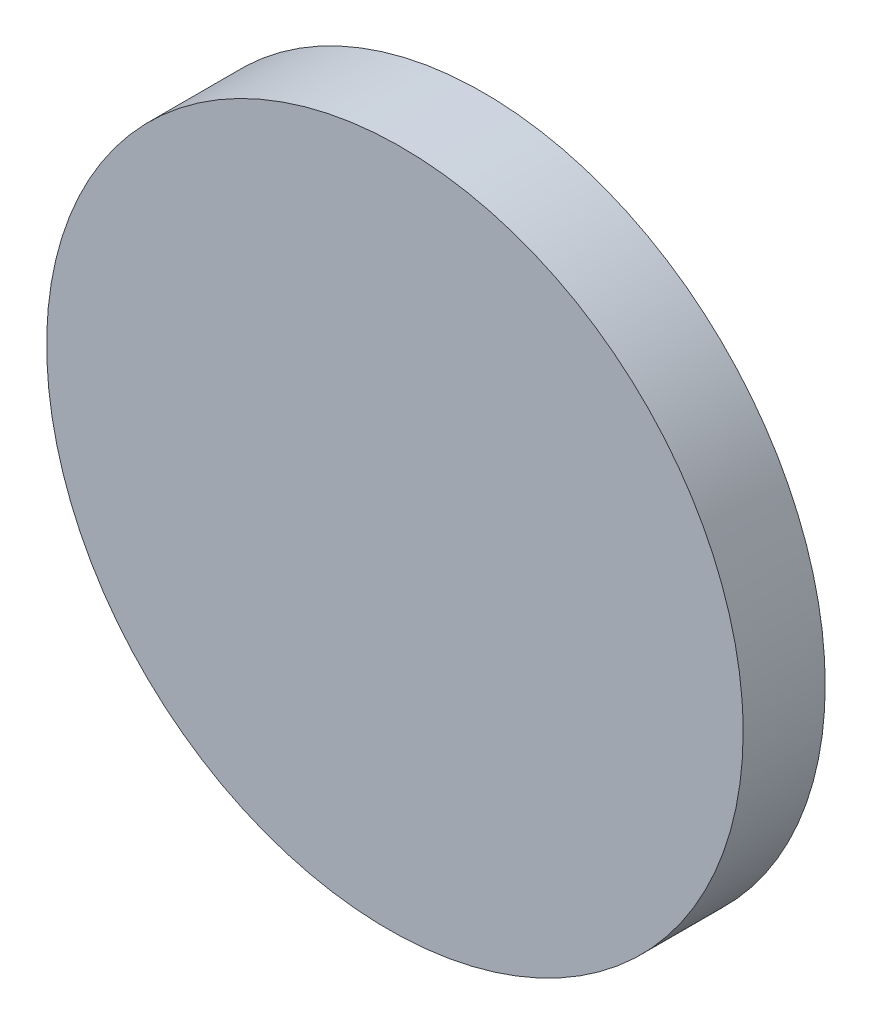
ISO-10303-21;
HEADER;
FILE_DESCRIPTION(('STEP AP214'),'2;1');
FILE_NAME('part.step','',(''),(''),'','','');
FILE_SCHEMA(('AUTOMOTIVE_DESIGN { 1 0 10303 214 1 1 1 1 }'));
ENDSEC;
DATA;
#1=APPLICATION_CONTEXT('core data for automotive mechanical design processes');
#2=APPLICATION_PROTOCOL_DEFINITION('international standard','automotive_design',2000,#1);
#3=PRODUCT_CONTEXT('',#1,'mechanical');
#4=PRODUCT('Part','Part','',(#3));
#5=PRODUCT_RELATED_PRODUCT_CATEGORY('part','',(#4));
#6=PRODUCT_DEFINITION_FORMATION('','',#4);
#7=PRODUCT_DEFINITION_CONTEXT('part definition',#1,'design');
#8=PRODUCT_DEFINITION('design','',#6,#7);
#9=PRODUCT_DEFINITION_SHAPE('','',#8);
#10=(LENGTH_UNIT() NAMED_UNIT(*) SI_UNIT(.MILLI.,.METRE.));
#11=(NAMED_UNIT(*) PLANE_ANGLE_UNIT() SI_UNIT($,.RADIAN.));
#12=(NAMED_UNIT(*) SI_UNIT($,.STERADIAN.) SOLID_ANGLE_UNIT());
#13=UNCERTAINTY_MEASURE_WITH_UNIT(LENGTH_MEASURE(1.E-05),#10,'distance_accuracy_value','');
#14=(GEOMETRIC_REPRESENTATION_CONTEXT(3) GLOBAL_UNCERTAINTY_ASSIGNED_CONTEXT((#13)) GLOBAL_UNIT_ASSIGNED_CONTEXT((#10,
#11,#12)) REPRESENTATION_CONTEXT('',''));
#15=CARTESIAN_POINT('',(0.,0.,0.));
#16=DIRECTION('',(0.,0.,1.));
#17=DIRECTION('',(1.,0.,0.));
#18=AXIS2_PLACEMENT_3D('',#15,#16,#17);
#19=CARTESIAN_POINT('',(0.,0.,10.));
#20=DIRECTION('',(0.,0.,-1.));
#21=DIRECTION('',(-1.,0.,0.));
#22=AXIS2_PLACEMENT_3D('',#19,#20,#21);
#23=CYLINDRICAL_SURFACE('',#22,12.5);
#24=CARTESIAN_POINT('',(0.,0.,3.22910011194622));
#25=DIRECTION('',(-0.0183249313961028,0.,-0.999832084346831));
#26=DIRECTION('',(0.999832084346831,0.,-0.0183249313961028));
#27=AXIS2_PLACEMENT_3D('',#24,#25,#26);
#28=ELLIPSE('',#27,12.5020992981696,12.5);
#29=CARTESIAN_POINT('',(12.5,0.,3.));
#30=VERTEX_POINT('',#29);
#31=EDGE_CURVE('E36',#30,#30,#28,.T.);
#32=ORIENTED_EDGE('',*,*,#31,.T.);
#33=EDGE_LOOP('',(#32));
#34=FACE_BOUND('',#33,.T.);
#35=CARTESIAN_POINT('',(0.,0.,0.));
#36=DIRECTION('',(0.,0.,1.));
#37=DIRECTION('',(1.,0.,0.));
#38=AXIS2_PLACEMENT_3D('',#35,#36,#37);
#39=CIRCLE('',#38,12.5);
#40=CARTESIAN_POINT('',(12.5,0.,0.));
#41=VERTEX_POINT('',#40);
#42=EDGE_CURVE('E10',#41,#41,#39,.T.);
#43=ORIENTED_EDGE('',*,*,#42,.T.);
#44=EDGE_LOOP('',(#43));
#45=FACE_BOUND('',#44,.T.);
#46=ADVANCED_FACE('F33',(#34,#45),#23,.T.);
#47=CARTESIAN_POINT('',(0.,0.,0.));
#48=DIRECTION('',(0.,0.,1.));
#49=DIRECTION('',(1.,0.,0.));
#50=AXIS2_PLACEMENT_3D('',#47,#48,#49);
#51=PLANE('',#50);
#52=ORIENTED_EDGE('',*,*,#42,.F.);
#53=EDGE_LOOP('',(#52));
#54=FACE_BOUND('',#53,.T.);
#55=ADVANCED_FACE('F48',(#54),#51,.F.);
#56=CARTESIAN_POINT('',(12.5,-25.,3.));
#57=DIRECTION('',(-0.0183249313961028,0.,-0.999832084346831));
#58=DIRECTION('',(-0.999832084346831,0.,0.0183249313961028));
#59=AXIS2_PLACEMENT_3D('',#56,#57,#58);
#60=PLANE('',#59);
#61=ORIENTED_EDGE('',*,*,#31,.F.);
#62=EDGE_LOOP('',(#61));
#63=FACE_BOUND('',#62,.T.);
#64=ADVANCED_FACE('F46',(#63),#60,.F.);
#65=CLOSED_SHELL('',(#46,#55,#64));
#66=MANIFOLD_SOLID_BREP('B2',#65);
#67=ADVANCED_BREP_SHAPE_REPRESENTATION('',(#18,#66),#14);
#68=SHAPE_DEFINITION_REPRESENTATION(#9,#67);
ENDSEC;
END-ISO-10303-21;
